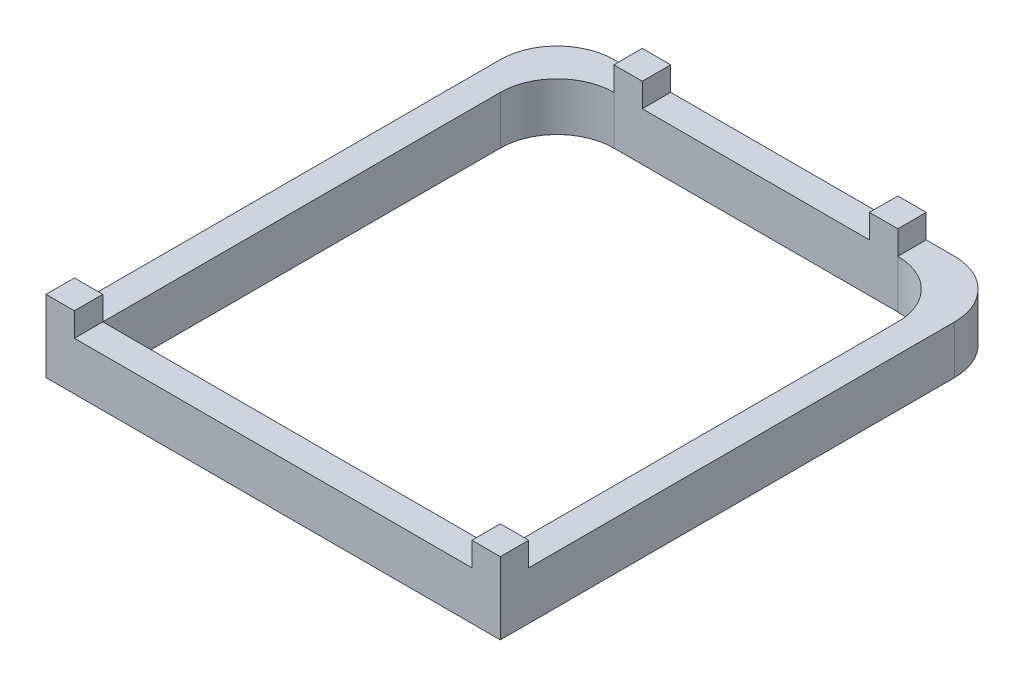
ISO-10303-21;
HEADER;
FILE_DESCRIPTION(('STEP AP214'),'2;1');
FILE_NAME('part.step','',(''),(''),'','','');
FILE_SCHEMA(('AUTOMOTIVE_DESIGN { 1 0 10303 214 1 1 1 1 }'));
ENDSEC;
DATA;
#1=APPLICATION_CONTEXT('core data for automotive mechanical design processes');
#2=APPLICATION_PROTOCOL_DEFINITION('international standard','automotive_design',2000,#1);
#3=PRODUCT_CONTEXT('',#1,'mechanical');
#4=PRODUCT('Part','Part','',(#3));
#5=PRODUCT_RELATED_PRODUCT_CATEGORY('part','',(#4));
#6=PRODUCT_DEFINITION_FORMATION('','',#4);
#7=PRODUCT_DEFINITION_CONTEXT('part definition',#1,'design');
#8=PRODUCT_DEFINITION('design','',#6,#7);
#9=PRODUCT_DEFINITION_SHAPE('','',#8);
#10=(LENGTH_UNIT() NAMED_UNIT(*) SI_UNIT(.MILLI.,.METRE.));
#11=(NAMED_UNIT(*) PLANE_ANGLE_UNIT() SI_UNIT($,.RADIAN.));
#12=(NAMED_UNIT(*) SI_UNIT($,.STERADIAN.) SOLID_ANGLE_UNIT());
#13=UNCERTAINTY_MEASURE_WITH_UNIT(LENGTH_MEASURE(1.E-05),#10,'distance_accuracy_value','');
#14=(GEOMETRIC_REPRESENTATION_CONTEXT(3) GLOBAL_UNCERTAINTY_ASSIGNED_CONTEXT((#13)) GLOBAL_UNIT_ASSIGNED_CONTEXT((#10,
#11,#12)) REPRESENTATION_CONTEXT('',''));
#15=CARTESIAN_POINT('',(0.,0.,0.));
#16=DIRECTION('',(0.,0.,1.));
#17=DIRECTION('',(1.,0.,0.));
#18=AXIS2_PLACEMENT_3D('',#15,#16,#17);
#19=CARTESIAN_POINT('',(-5.00000000000001,1.7,-6.));
#20=DIRECTION('',(0.,1.,0.));
#21=DIRECTION('',(0.,0.,1.));
#22=AXIS2_PLACEMENT_3D('',#19,#20,#21);
#23=PLANE('',#22);
#24=DIRECTION('',(-1.,0.,0.));
#25=VECTOR('',#24,1.);
#26=CARTESIAN_POINT('',(-5.99999999999999,1.7,-9.));
#27=LINE('',#26,#25);
#28=CARTESIAN_POINT('',(5.99999999999999,1.7,-9.));
#29=VERTEX_POINT('',#28);
#30=CARTESIAN_POINT('',(4.99999999999998,1.7,-9.));
#31=VERTEX_POINT('',#30);
#32=EDGE_CURVE('E350',#29,#31,#27,.T.);
#33=ORIENTED_EDGE('',*,*,#32,.T.);
#34=DIRECTION('',(0.,0.,-1.));
#35=VECTOR('',#34,1.);
#36=CARTESIAN_POINT('',(4.99999999999998,1.7,-8.));
#37=LINE('',#36,#35);
#38=CARTESIAN_POINT('',(4.99999999999998,1.7,-8.));
#39=VERTEX_POINT('',#38);
#40=EDGE_CURVE('E701',#39,#31,#37,.T.);
#41=ORIENTED_EDGE('',*,*,#40,.F.);
#42=CARTESIAN_POINT('',(4.99999999999999,1.7,-6.));
#43=DIRECTION('',(0.,1.,0.));
#44=DIRECTION('',(0.,0.,-1.));
#45=AXIS2_PLACEMENT_3D('',#42,#43,#44);
#46=CIRCLE('',#45,2.);
#47=CARTESIAN_POINT('',(6.99999999999999,1.7,-5.99999999999998));
#48=VERTEX_POINT('',#47);
#49=EDGE_CURVE('E300',#48,#39,#46,.T.);
#50=ORIENTED_EDGE('',*,*,#49,.F.);
#51=DIRECTION('',(0.,0.,-1.));
#52=VECTOR('',#51,1.);
#53=CARTESIAN_POINT('',(6.99999999999999,1.7,-5.99999999999998));
#54=LINE('',#53,#52);
#55=CARTESIAN_POINT('',(6.99999999999999,1.7,8.));
#56=VERTEX_POINT('',#55);
#57=EDGE_CURVE('E298',#56,#48,#54,.T.);
#58=ORIENTED_EDGE('',*,*,#57,.F.);
#59=DIRECTION('',(-1.,0.,0.));
#60=VECTOR('',#59,1.);
#61=CARTESIAN_POINT('',(6.99999999999999,1.7,8.));
#62=LINE('',#61,#60);
#63=CARTESIAN_POINT('',(8.00000000000001,1.7,8.));
#64=VERTEX_POINT('',#63);
#65=EDGE_CURVE('E58',#64,#56,#62,.T.);
#66=ORIENTED_EDGE('',*,*,#65,.F.);
#67=DIRECTION('',(0.,0.,-1.));
#68=VECTOR('',#67,1.);
#69=CARTESIAN_POINT('',(8.00000000000001,1.7,-6.99999999999998));
#70=LINE('',#69,#68);
#71=CARTESIAN_POINT('',(8.00000000000001,1.7,-6.99999999999998));
#72=VERTEX_POINT('',#71);
#73=EDGE_CURVE('E344',#64,#72,#70,.T.);
#74=ORIENTED_EDGE('',*,*,#73,.T.);
#75=CARTESIAN_POINT('',(6.00000000000001,1.7,-7.));
#76=DIRECTION('',(0.,1.,0.));
#77=DIRECTION('',(0.,0.,-1.));
#78=AXIS2_PLACEMENT_3D('',#75,#76,#77);
#79=CIRCLE('',#78,2.);
#80=EDGE_CURVE('E346',#72,#29,#79,.T.);
#81=ORIENTED_EDGE('',*,*,#80,.T.);
#82=EDGE_LOOP('',(#33,#41,#50,#58,#66,#74,#81));
#83=FACE_BOUND('',#82,.T.);
#84=ADVANCED_FACE('F35',(#83),#23,.T.);
#85=DIRECTION('',(-1.,0.,0.));
#86=VECTOR('',#85,1.);
#87=CARTESIAN_POINT('',(-4.99999999999999,1.7,-8.));
#88=LINE('',#87,#86);
#89=CARTESIAN_POINT('',(3.99999999999998,1.7,-8.));
#90=VERTEX_POINT('',#89);
#91=CARTESIAN_POINT('',(-4.00000000000001,1.7,-8.));
#92=VERTEX_POINT('',#91);
#93=EDGE_CURVE('E304',#90,#92,#88,.T.);
#94=ORIENTED_EDGE('',*,*,#93,.F.);
#95=DIRECTION('',(0.,0.,1.));
#96=VECTOR('',#95,1.);
#97=CARTESIAN_POINT('',(3.99999999999998,1.7,-9.));
#98=LINE('',#97,#96);
#99=CARTESIAN_POINT('',(3.99999999999998,1.7,-9.));
#100=VERTEX_POINT('',#99);
#101=EDGE_CURVE('E213',#100,#90,#98,.T.);
#102=ORIENTED_EDGE('',*,*,#101,.F.);
#103=CARTESIAN_POINT('',(-4.00000000000001,1.7,-9.));
#104=VERTEX_POINT('',#103);
#105=EDGE_CURVE('E354',#100,#104,#27,.T.);
#106=ORIENTED_EDGE('',*,*,#105,.T.);
#107=DIRECTION('',(0.,0.,-1.));
#108=VECTOR('',#107,1.);
#109=CARTESIAN_POINT('',(-4.00000000000001,1.7,-9.));
#110=LINE('',#109,#108);
#111=EDGE_CURVE('E219',#92,#104,#110,.T.);
#112=ORIENTED_EDGE('',*,*,#111,.F.);
#113=EDGE_LOOP('',(#94,#102,#106,#112));
#114=FACE_BOUND('',#113,.T.);
#115=ADVANCED_FACE('F458',(#114),#23,.T.);
#116=CARTESIAN_POINT('',(-5.00000000000001,1.7,-6.));
#117=DIRECTION('',(0.,1.,0.));
#118=DIRECTION('',(0.,0.,1.));
#119=AXIS2_PLACEMENT_3D('',#116,#117,#118);
#120=CIRCLE('',#119,2.);
#121=CARTESIAN_POINT('',(-4.99999999999999,1.7,-8.));
#122=VERTEX_POINT('',#121);
#123=CARTESIAN_POINT('',(-7.00000000000001,1.7,-5.99999999999998));
#124=VERTEX_POINT('',#123);
#125=EDGE_CURVE('E306',#122,#124,#120,.T.);
#126=ORIENTED_EDGE('',*,*,#125,.F.);
#127=DIRECTION('',(0.,0.,1.));
#128=VECTOR('',#127,1.);
#129=CARTESIAN_POINT('',(-4.99999999999999,1.7,-8.));
#130=LINE('',#129,#128);
#131=CARTESIAN_POINT('',(-5.00000000000001,1.7,-9.));
#132=VERTEX_POINT('',#131);
#133=EDGE_CURVE('E222',#132,#122,#130,.T.);
#134=ORIENTED_EDGE('',*,*,#133,.F.);
#135=CARTESIAN_POINT('',(-5.99999999999999,1.7,-9.));
#136=VERTEX_POINT('',#135);
#137=EDGE_CURVE('E349',#132,#136,#27,.T.);
#138=ORIENTED_EDGE('',*,*,#137,.T.);
#139=CARTESIAN_POINT('',(-6.00000000000001,1.7,-7.));
#140=DIRECTION('',(0.,1.,0.));
#141=DIRECTION('',(0.,0.,1.));
#142=AXIS2_PLACEMENT_3D('',#139,#140,#141);
#143=CIRCLE('',#142,2.);
#144=CARTESIAN_POINT('',(-8.00000000000001,1.7,-6.99999999999998));
#145=VERTEX_POINT('',#144);
#146=EDGE_CURVE('E353',#136,#145,#143,.T.);
#147=ORIENTED_EDGE('',*,*,#146,.T.);
#148=DIRECTION('',(0.,0.,1.));
#149=VECTOR('',#148,1.);
#150=CARTESIAN_POINT('',(-8.00000000000001,1.7,-6.99999999999998));
#151=LINE('',#150,#149);
#152=CARTESIAN_POINT('',(-8.00000000000001,1.7,8.));
#153=VERTEX_POINT('',#152);
#154=EDGE_CURVE('E356',#145,#153,#151,.T.);
#155=ORIENTED_EDGE('',*,*,#154,.T.);
#156=DIRECTION('',(-1.,0.,0.));
#157=VECTOR('',#156,1.);
#158=CARTESIAN_POINT('',(-7.00000000000001,1.7,8.));
#159=LINE('',#158,#157);
#160=CARTESIAN_POINT('',(-7.00000000000001,1.7,8.));
#161=VERTEX_POINT('',#160);
#162=EDGE_CURVE('E277',#161,#153,#159,.T.);
#163=ORIENTED_EDGE('',*,*,#162,.F.);
#164=DIRECTION('',(0.,0.,1.));
#165=VECTOR('',#164,1.);
#166=CARTESIAN_POINT('',(-7.00000000000001,1.7,-5.99999999999998));
#167=LINE('',#166,#165);
#168=EDGE_CURVE('E308',#124,#161,#167,.T.);
#169=ORIENTED_EDGE('',*,*,#168,.F.);
#170=EDGE_LOOP('',(#126,#134,#138,#147,#155,#163,#169));
#171=FACE_BOUND('',#170,.T.);
#172=ADVANCED_FACE('F408',(#171),#23,.T.);
#173=DIRECTION('',(1.,0.,0.));
#174=VECTOR('',#173,1.);
#175=CARTESIAN_POINT('',(-8.00000000000001,1.7,9.));
#176=LINE('',#175,#174);
#177=CARTESIAN_POINT('',(-7.00000000000001,1.7,9.));
#178=VERTEX_POINT('',#177);
#179=CARTESIAN_POINT('',(6.99999999999999,1.7,9.));
#180=VERTEX_POINT('',#179);
#181=EDGE_CURVE('E358',#178,#180,#176,.T.);
#182=ORIENTED_EDGE('',*,*,#181,.T.);
#183=DIRECTION('',(0.,0.,1.));
#184=VECTOR('',#183,1.);
#185=CARTESIAN_POINT('',(6.99999999999999,1.7,8.));
#186=LINE('',#185,#184);
#187=EDGE_CURVE('E249',#56,#180,#186,.T.);
#188=ORIENTED_EDGE('',*,*,#187,.F.);
#189=DIRECTION('',(1.,0.,0.));
#190=VECTOR('',#189,1.);
#191=CARTESIAN_POINT('',(-7.00000000000001,1.7,8.));
#192=LINE('',#191,#190);
#193=EDGE_CURVE('E311',#161,#56,#192,.T.);
#194=ORIENTED_EDGE('',*,*,#193,.F.);
#195=DIRECTION('',(0.,0.,-1.));
#196=VECTOR('',#195,1.);
#197=CARTESIAN_POINT('',(-7.00000000000001,1.7,8.));
#198=LINE('',#197,#196);
#199=EDGE_CURVE('E272',#178,#161,#198,.T.);
#200=ORIENTED_EDGE('',*,*,#199,.F.);
#201=EDGE_LOOP('',(#182,#188,#194,#200));
#202=FACE_BOUND('',#201,.T.);
#203=ADVANCED_FACE('F421',(#202),#23,.T.);
#204=CARTESIAN_POINT('',(-5.00000000000001,0.,-6.));
#205=DIRECTION('',(0.,1.,0.));
#206=DIRECTION('',(0.,0.,1.));
#207=AXIS2_PLACEMENT_3D('',#204,#205,#206);
#208=PLANE('',#207);
#209=DIRECTION('',(0.,0.,-1.));
#210=VECTOR('',#209,1.);
#211=CARTESIAN_POINT('',(8.00000000000001,0.,-6.99999999999998));
#212=LINE('',#211,#210);
#213=CARTESIAN_POINT('',(8.00000000000001,0.,9.));
#214=VERTEX_POINT('',#213);
#215=CARTESIAN_POINT('',(8.00000000000001,0.,-6.99999999999998));
#216=VERTEX_POINT('',#215);
#217=EDGE_CURVE('E343',#214,#216,#212,.T.);
#218=ORIENTED_EDGE('',*,*,#217,.F.);
#219=DIRECTION('',(1.,0.,0.));
#220=VECTOR('',#219,1.);
#221=CARTESIAN_POINT('',(-8.00000000000001,0.,9.));
#222=LINE('',#221,#220);
#223=CARTESIAN_POINT('',(-8.00000000000001,0.,9.));
#224=VERTEX_POINT('',#223);
#225=EDGE_CURVE('E347',#224,#214,#222,.T.);
#226=ORIENTED_EDGE('',*,*,#225,.F.);
#227=DIRECTION('',(0.,0.,1.));
#228=VECTOR('',#227,1.);
#229=CARTESIAN_POINT('',(-8.00000000000001,0.,-6.99999999999998));
#230=LINE('',#229,#228);
#231=CARTESIAN_POINT('',(-8.00000000000001,0.,-6.99999999999998));
#232=VERTEX_POINT('',#231);
#233=EDGE_CURVE('E369',#232,#224,#230,.T.);
#234=ORIENTED_EDGE('',*,*,#233,.F.);
#235=CARTESIAN_POINT('',(-6.00000000000001,0.,-7.));
#236=DIRECTION('',(0.,1.,0.));
#237=DIRECTION('',(0.,0.,1.));
#238=AXIS2_PLACEMENT_3D('',#235,#236,#237);
#239=CIRCLE('',#238,2.);
#240=CARTESIAN_POINT('',(-5.99999999999999,0.,-9.));
#241=VERTEX_POINT('',#240);
#242=EDGE_CURVE('E367',#241,#232,#239,.T.);
#243=ORIENTED_EDGE('',*,*,#242,.F.);
#244=DIRECTION('',(-1.,0.,0.));
#245=VECTOR('',#244,1.);
#246=CARTESIAN_POINT('',(-5.99999999999999,0.,-9.));
#247=LINE('',#246,#245);
#248=CARTESIAN_POINT('',(5.99999999999999,0.,-9.));
#249=VERTEX_POINT('',#248);
#250=EDGE_CURVE('E365',#249,#241,#247,.T.);
#251=ORIENTED_EDGE('',*,*,#250,.F.);
#252=CARTESIAN_POINT('',(6.00000000000001,0.,-7.));
#253=DIRECTION('',(0.,1.,0.));
#254=DIRECTION('',(0.,0.,-1.));
#255=AXIS2_PLACEMENT_3D('',#252,#253,#254);
#256=CIRCLE('',#255,2.);
#257=EDGE_CURVE('E363',#216,#249,#256,.T.);
#258=ORIENTED_EDGE('',*,*,#257,.F.);
#259=EDGE_LOOP('',(#218,#226,#234,#243,#251,#258));
#260=FACE_BOUND('',#259,.T.);
#261=DIRECTION('',(0.,0.,-1.));
#262=VECTOR('',#261,1.);
#263=CARTESIAN_POINT('',(6.99999999999999,0.,-5.99999999999998));
#264=LINE('',#263,#262);
#265=CARTESIAN_POINT('',(6.99999999999999,0.,8.));
#266=VERTEX_POINT('',#265);
#267=CARTESIAN_POINT('',(6.99999999999999,0.,-5.99999999999998));
#268=VERTEX_POINT('',#267);
#269=EDGE_CURVE('E297',#266,#268,#264,.T.);
#270=ORIENTED_EDGE('',*,*,#269,.T.);
#271=CARTESIAN_POINT('',(4.99999999999999,0.,-6.));
#272=DIRECTION('',(0.,1.,0.));
#273=DIRECTION('',(0.,0.,-1.));
#274=AXIS2_PLACEMENT_3D('',#271,#272,#273);
#275=CIRCLE('',#274,2.);
#276=CARTESIAN_POINT('',(4.99999999999998,0.,-8.));
#277=VERTEX_POINT('',#276);
#278=EDGE_CURVE('E317',#268,#277,#275,.T.);
#279=ORIENTED_EDGE('',*,*,#278,.T.);
#280=DIRECTION('',(-1.,0.,0.));
#281=VECTOR('',#280,1.);
#282=CARTESIAN_POINT('',(-4.99999999999999,0.,-8.));
#283=LINE('',#282,#281);
#284=CARTESIAN_POINT('',(-4.99999999999999,0.,-8.));
#285=VERTEX_POINT('',#284);
#286=EDGE_CURVE('E320',#277,#285,#283,.T.);
#287=ORIENTED_EDGE('',*,*,#286,.T.);
#288=CARTESIAN_POINT('',(-5.00000000000001,0.,-6.));
#289=DIRECTION('',(0.,1.,0.));
#290=DIRECTION('',(0.,0.,1.));
#291=AXIS2_PLACEMENT_3D('',#288,#289,#290);
#292=CIRCLE('',#291,2.);
#293=CARTESIAN_POINT('',(-7.00000000000001,0.,-5.99999999999998));
#294=VERTEX_POINT('',#293);
#295=EDGE_CURVE('E323',#285,#294,#292,.T.);
#296=ORIENTED_EDGE('',*,*,#295,.T.);
#297=DIRECTION('',(0.,0.,1.));
#298=VECTOR('',#297,1.);
#299=CARTESIAN_POINT('',(-7.00000000000001,0.,-5.99999999999998));
#300=LINE('',#299,#298);
#301=CARTESIAN_POINT('',(-7.00000000000001,0.,8.));
#302=VERTEX_POINT('',#301);
#303=EDGE_CURVE('E326',#294,#302,#300,.T.);
#304=ORIENTED_EDGE('',*,*,#303,.T.);
#305=DIRECTION('',(1.,0.,0.));
#306=VECTOR('',#305,1.);
#307=CARTESIAN_POINT('',(-7.00000000000001,0.,8.));
#308=LINE('',#307,#306);
#309=EDGE_CURVE('E301',#302,#266,#308,.T.);
#310=ORIENTED_EDGE('',*,*,#309,.T.);
#311=EDGE_LOOP('',(#270,#279,#287,#296,#304,#310));
#312=FACE_BOUND('',#311,.T.);
#313=ADVANCED_FACE('F37',(#260,#312),#208,.F.);
#314=CARTESIAN_POINT('',(8.00000000000001,1.7,-6.99999999999998));
#315=DIRECTION('',(-1.,0.,0.));
#316=DIRECTION('',(0.,0.,1.));
#317=AXIS2_PLACEMENT_3D('',#314,#315,#316);
#318=PLANE('',#317);
#319=ORIENTED_EDGE('',*,*,#217,.T.);
#320=DIRECTION('',(0.,-1.,0.));
#321=VECTOR('',#320,1.);
#322=CARTESIAN_POINT('',(8.00000000000001,1.7,-6.99999999999998));
#323=LINE('',#322,#321);
#324=EDGE_CURVE('E11',#72,#216,#323,.T.);
#325=ORIENTED_EDGE('',*,*,#324,.F.);
#326=ORIENTED_EDGE('',*,*,#73,.F.);
#327=DIRECTION('',(0.,-1.,0.));
#328=VECTOR('',#327,1.);
#329=CARTESIAN_POINT('',(8.00000000000001,2.54,8.));
#330=LINE('',#329,#328);
#331=CARTESIAN_POINT('',(8.00000000000001,2.54,8.));
#332=VERTEX_POINT('',#331);
#333=EDGE_CURVE('E266',#332,#64,#330,.T.);
#334=ORIENTED_EDGE('',*,*,#333,.F.);
#335=DIRECTION('',(0.,0.,-1.));
#336=VECTOR('',#335,1.);
#337=CARTESIAN_POINT('',(8.00000000000001,2.54,8.));
#338=LINE('',#337,#336);
#339=CARTESIAN_POINT('',(8.00000000000001,2.54,9.));
#340=VERTEX_POINT('',#339);
#341=EDGE_CURVE('E256',#340,#332,#338,.T.);
#342=ORIENTED_EDGE('',*,*,#341,.F.);
#343=DIRECTION('',(0.,-1.,0.));
#344=VECTOR('',#343,1.);
#345=CARTESIAN_POINT('',(8.00000000000001,1.7,9.));
#346=LINE('',#345,#344);
#347=EDGE_CURVE('E360',#340,#214,#346,.T.);
#348=ORIENTED_EDGE('',*,*,#347,.T.);
#349=EDGE_LOOP('',(#319,#325,#326,#334,#342,#348));
#350=FACE_BOUND('',#349,.T.);
#351=ADVANCED_FACE('F444',(#350),#318,.F.);
#352=CARTESIAN_POINT('',(6.00000000000001,1.7,-7.));
#353=DIRECTION('',(0.,-1.,0.));
#354=DIRECTION('',(0.,0.,-1.));
#355=AXIS2_PLACEMENT_3D('',#352,#353,#354);
#356=CYLINDRICAL_SURFACE('',#355,2.);
#357=ORIENTED_EDGE('',*,*,#257,.T.);
#358=DIRECTION('',(0.,-1.,0.));
#359=VECTOR('',#358,1.);
#360=CARTESIAN_POINT('',(5.99999999999999,1.7,-9.));
#361=LINE('',#360,#359);
#362=EDGE_CURVE('E43',#29,#249,#361,.T.);
#363=ORIENTED_EDGE('',*,*,#362,.F.);
#364=ORIENTED_EDGE('',*,*,#80,.F.);
#365=ORIENTED_EDGE('',*,*,#324,.T.);
#366=EDGE_LOOP('',(#357,#363,#364,#365));
#367=FACE_BOUND('',#366,.T.);
#368=ADVANCED_FACE('F446',(#367),#356,.T.);
#369=CARTESIAN_POINT('',(-5.99999999999999,1.7,-9.));
#370=DIRECTION('',(0.,0.,1.));
#371=DIRECTION('',(1.,0.,0.));
#372=AXIS2_PLACEMENT_3D('',#369,#370,#371);
#373=PLANE('',#372);
#374=ORIENTED_EDGE('',*,*,#250,.T.);
#375=DIRECTION('',(0.,-1.,0.));
#376=VECTOR('',#375,1.);
#377=CARTESIAN_POINT('',(-5.99999999999999,1.7,-9.));
#378=LINE('',#377,#376);
#379=EDGE_CURVE('E380',#136,#241,#378,.T.);
#380=ORIENTED_EDGE('',*,*,#379,.F.);
#381=ORIENTED_EDGE('',*,*,#137,.F.);
#382=DIRECTION('',(0.,-1.,0.));
#383=VECTOR('',#382,1.);
#384=CARTESIAN_POINT('',(-5.00000000000001,2.54,-9.));
#385=LINE('',#384,#383);
#386=CARTESIAN_POINT('',(-5.00000000000001,2.54,-9.));
#387=VERTEX_POINT('',#386);
#388=EDGE_CURVE('E241',#387,#132,#385,.T.);
#389=ORIENTED_EDGE('',*,*,#388,.F.);
#390=DIRECTION('',(-1.,0.,0.));
#391=VECTOR('',#390,1.);
#392=CARTESIAN_POINT('',(-5.00000000000001,2.54,-9.));
#393=LINE('',#392,#391);
#394=CARTESIAN_POINT('',(-4.00000000000001,2.54,-9.));
#395=VERTEX_POINT('',#394);
#396=EDGE_CURVE('E233',#395,#387,#393,.T.);
#397=ORIENTED_EDGE('',*,*,#396,.F.);
#398=DIRECTION('',(0.,-1.,0.));
#399=VECTOR('',#398,1.);
#400=CARTESIAN_POINT('',(-4.00000000000001,2.54,-9.));
#401=LINE('',#400,#399);
#402=EDGE_CURVE('E243',#395,#104,#401,.T.);
#403=ORIENTED_EDGE('',*,*,#402,.T.);
#404=ORIENTED_EDGE('',*,*,#105,.F.);
#405=DIRECTION('',(0.,-1.,0.));
#406=VECTOR('',#405,1.);
#407=CARTESIAN_POINT('',(3.99999999999998,2.54,-9.));
#408=LINE('',#407,#406);
#409=CARTESIAN_POINT('',(3.99999999999998,2.54,-9.));
#410=VERTEX_POINT('',#409);
#411=EDGE_CURVE('E224',#410,#100,#408,.T.);
#412=ORIENTED_EDGE('',*,*,#411,.F.);
#413=DIRECTION('',(-1.,0.,0.));
#414=VECTOR('',#413,1.);
#415=CARTESIAN_POINT('',(4.99999999999998,2.54,-9.));
#416=LINE('',#415,#414);
#417=CARTESIAN_POINT('',(4.99999999999998,2.54,-9.));
#418=VERTEX_POINT('',#417);
#419=EDGE_CURVE('E207',#418,#410,#416,.T.);
#420=ORIENTED_EDGE('',*,*,#419,.F.);
#421=DIRECTION('',(0.,-1.,0.));
#422=VECTOR('',#421,1.);
#423=CARTESIAN_POINT('',(4.99999999999998,2.54,-9.));
#424=LINE('',#423,#422);
#425=EDGE_CURVE('E204',#418,#31,#424,.T.);
#426=ORIENTED_EDGE('',*,*,#425,.T.);
#427=ORIENTED_EDGE('',*,*,#32,.F.);
#428=ORIENTED_EDGE('',*,*,#362,.T.);
#429=EDGE_LOOP('',(#374,#380,#381,#389,#397,#403,#404,#412,#420,#426,#427,#428));
#430=FACE_BOUND('',#429,.T.);
#431=ADVANCED_FACE('F387',(#430),#373,.F.);
#432=CARTESIAN_POINT('',(-6.00000000000001,1.7,-7.));
#433=DIRECTION('',(0.,-1.,0.));
#434=DIRECTION('',(0.,0.,-1.));
#435=AXIS2_PLACEMENT_3D('',#432,#433,#434);
#436=CYLINDRICAL_SURFACE('',#435,2.);
#437=ORIENTED_EDGE('',*,*,#242,.T.);
#438=DIRECTION('',(0.,-1.,0.));
#439=VECTOR('',#438,1.);
#440=CARTESIAN_POINT('',(-8.00000000000001,1.7,-6.99999999999998));
#441=LINE('',#440,#439);
#442=EDGE_CURVE('E377',#145,#232,#441,.T.);
#443=ORIENTED_EDGE('',*,*,#442,.F.);
#444=ORIENTED_EDGE('',*,*,#146,.F.);
#445=ORIENTED_EDGE('',*,*,#379,.T.);
#446=EDGE_LOOP('',(#437,#443,#444,#445));
#447=FACE_BOUND('',#446,.T.);
#448=ADVANCED_FACE('F399',(#447),#436,.T.);
#449=CARTESIAN_POINT('',(-8.00000000000001,1.7,-6.99999999999998));
#450=DIRECTION('',(1.,0.,0.));
#451=DIRECTION('',(0.,0.,-1.));
#452=AXIS2_PLACEMENT_3D('',#449,#450,#451);
#453=PLANE('',#452);
#454=ORIENTED_EDGE('',*,*,#233,.T.);
#455=DIRECTION('',(0.,-1.,0.));
#456=VECTOR('',#455,1.);
#457=CARTESIAN_POINT('',(-8.00000000000001,1.7,9.));
#458=LINE('',#457,#456);
#459=CARTESIAN_POINT('',(-8.00000000000001,2.54,9.));
#460=VERTEX_POINT('',#459);
#461=EDGE_CURVE('E374',#460,#224,#458,.T.);
#462=ORIENTED_EDGE('',*,*,#461,.F.);
#463=DIRECTION('',(0.,0.,1.));
#464=VECTOR('',#463,1.);
#465=CARTESIAN_POINT('',(-8.00000000000001,2.54,8.));
#466=LINE('',#465,#464);
#467=CARTESIAN_POINT('',(-8.00000000000001,2.54,8.));
#468=VERTEX_POINT('',#467);
#469=EDGE_CURVE('E279',#468,#460,#466,.T.);
#470=ORIENTED_EDGE('',*,*,#469,.F.);
#471=DIRECTION('',(0.,-1.,0.));
#472=VECTOR('',#471,1.);
#473=CARTESIAN_POINT('',(-8.00000000000001,2.54,8.));
#474=LINE('',#473,#472);
#475=EDGE_CURVE('E291',#468,#153,#474,.T.);
#476=ORIENTED_EDGE('',*,*,#475,.T.);
#477=ORIENTED_EDGE('',*,*,#154,.F.);
#478=ORIENTED_EDGE('',*,*,#442,.T.);
#479=EDGE_LOOP('',(#454,#462,#470,#476,#477,#478));
#480=FACE_BOUND('',#479,.T.);
#481=ADVANCED_FACE('F403',(#480),#453,.F.);
#482=CARTESIAN_POINT('',(-8.00000000000001,1.7,9.));
#483=DIRECTION('',(0.,0.,-1.));
#484=DIRECTION('',(-1.,0.,0.));
#485=AXIS2_PLACEMENT_3D('',#482,#483,#484);
#486=PLANE('',#485);
#487=ORIENTED_EDGE('',*,*,#225,.T.);
#488=ORIENTED_EDGE('',*,*,#347,.F.);
#489=DIRECTION('',(1.,0.,0.));
#490=VECTOR('',#489,1.);
#491=CARTESIAN_POINT('',(6.99999999999999,2.54,9.));
#492=LINE('',#491,#490);
#493=CARTESIAN_POINT('',(6.99999999999999,2.54,9.));
#494=VERTEX_POINT('',#493);
#495=EDGE_CURVE('E253',#494,#340,#492,.T.);
#496=ORIENTED_EDGE('',*,*,#495,.F.);
#497=DIRECTION('',(0.,-1.,0.));
#498=VECTOR('',#497,1.);
#499=CARTESIAN_POINT('',(6.99999999999999,2.54,9.));
#500=LINE('',#499,#498);
#501=EDGE_CURVE('E269',#494,#180,#500,.T.);
#502=ORIENTED_EDGE('',*,*,#501,.T.);
#503=ORIENTED_EDGE('',*,*,#181,.F.);
#504=DIRECTION('',(0.,-1.,0.));
#505=VECTOR('',#504,1.);
#506=CARTESIAN_POINT('',(-7.00000000000001,2.54,9.));
#507=LINE('',#506,#505);
#508=CARTESIAN_POINT('',(-7.00000000000001,2.54,9.));
#509=VERTEX_POINT('',#508);
#510=EDGE_CURVE('E284',#509,#178,#507,.T.);
#511=ORIENTED_EDGE('',*,*,#510,.F.);
#512=DIRECTION('',(1.,0.,0.));
#513=VECTOR('',#512,1.);
#514=CARTESIAN_POINT('',(-7.00000000000001,2.54,9.));
#515=LINE('',#514,#513);
#516=EDGE_CURVE('E282',#460,#509,#515,.T.);
#517=ORIENTED_EDGE('',*,*,#516,.F.);
#518=ORIENTED_EDGE('',*,*,#461,.T.);
#519=EDGE_LOOP('',(#487,#488,#496,#502,#503,#511,#517,#518));
#520=FACE_BOUND('',#519,.T.);
#521=ADVANCED_FACE('F423',(#520),#486,.F.);
#522=CARTESIAN_POINT('',(6.99999999999999,1.7,-5.99999999999998));
#523=DIRECTION('',(-1.,0.,0.));
#524=DIRECTION('',(0.,0.,1.));
#525=AXIS2_PLACEMENT_3D('',#522,#523,#524);
#526=PLANE('',#525);
#527=ORIENTED_EDGE('',*,*,#269,.F.);
#528=DIRECTION('',(0.,-1.,0.));
#529=VECTOR('',#528,1.);
#530=CARTESIAN_POINT('',(6.99999999999999,1.7,8.));
#531=LINE('',#530,#529);
#532=EDGE_CURVE('E314',#56,#266,#531,.T.);
#533=ORIENTED_EDGE('',*,*,#532,.F.);
#534=ORIENTED_EDGE('',*,*,#57,.T.);
#535=DIRECTION('',(0.,-1.,0.));
#536=VECTOR('',#535,1.);
#537=CARTESIAN_POINT('',(6.99999999999999,1.7,-5.99999999999998));
#538=LINE('',#537,#536);
#539=EDGE_CURVE('E340',#48,#268,#538,.T.);
#540=ORIENTED_EDGE('',*,*,#539,.T.);
#541=EDGE_LOOP('',(#527,#533,#534,#540));
#542=FACE_BOUND('',#541,.T.);
#543=ADVANCED_FACE('F435',(#542),#526,.T.);
#544=CARTESIAN_POINT('',(4.99999999999999,1.7,-6.));
#545=DIRECTION('',(0.,-1.,0.));
#546=DIRECTION('',(0.,0.,-1.));
#547=AXIS2_PLACEMENT_3D('',#544,#545,#546);
#548=CYLINDRICAL_SURFACE('',#547,2.);
#549=ORIENTED_EDGE('',*,*,#278,.F.);
#550=ORIENTED_EDGE('',*,*,#539,.F.);
#551=ORIENTED_EDGE('',*,*,#49,.T.);
#552=DIRECTION('',(0.,-1.,0.));
#553=VECTOR('',#552,1.);
#554=CARTESIAN_POINT('',(4.99999999999998,1.7,-8.));
#555=LINE('',#554,#553);
#556=EDGE_CURVE('E218',#39,#277,#555,.T.);
#557=ORIENTED_EDGE('',*,*,#556,.T.);
#558=EDGE_LOOP('',(#549,#550,#551,#557));
#559=FACE_BOUND('',#558,.T.);
#560=ADVANCED_FACE('F548',(#559),#548,.F.);
#561=CARTESIAN_POINT('',(-4.99999999999999,1.7,-8.));
#562=DIRECTION('',(0.,0.,1.));
#563=DIRECTION('',(1.,0.,0.));
#564=AXIS2_PLACEMENT_3D('',#561,#562,#563);
#565=PLANE('',#564);
#566=ORIENTED_EDGE('',*,*,#286,.F.);
#567=ORIENTED_EDGE('',*,*,#556,.F.);
#568=DIRECTION('',(0.,-1.,0.));
#569=VECTOR('',#568,1.);
#570=CARTESIAN_POINT('',(4.99999999999998,2.54,-8.));
#571=LINE('',#570,#569);
#572=CARTESIAN_POINT('',(4.99999999999998,2.54,-8.));
#573=VERTEX_POINT('',#572);
#574=EDGE_CURVE('E201',#573,#39,#571,.T.);
#575=ORIENTED_EDGE('',*,*,#574,.F.);
#576=DIRECTION('',(1.,0.,0.));
#577=VECTOR('',#576,1.);
#578=CARTESIAN_POINT('',(3.99999999999998,2.54,-8.));
#579=LINE('',#578,#577);
#580=CARTESIAN_POINT('',(3.99999999999998,2.54,-8.));
#581=VERTEX_POINT('',#580);
#582=EDGE_CURVE('E208',#581,#573,#579,.T.);
#583=ORIENTED_EDGE('',*,*,#582,.F.);
#584=DIRECTION('',(0.,-1.,0.));
#585=VECTOR('',#584,1.);
#586=CARTESIAN_POINT('',(3.99999999999998,2.54,-8.));
#587=LINE('',#586,#585);
#588=EDGE_CURVE('E50',#581,#90,#587,.T.);
#589=ORIENTED_EDGE('',*,*,#588,.T.);
#590=ORIENTED_EDGE('',*,*,#93,.T.);
#591=DIRECTION('',(0.,-1.,0.));
#592=VECTOR('',#591,1.);
#593=CARTESIAN_POINT('',(-4.00000000000001,2.54,-8.));
#594=LINE('',#593,#592);
#595=CARTESIAN_POINT('',(-4.00000000000001,2.54,-8.));
#596=VERTEX_POINT('',#595);
#597=EDGE_CURVE('E246',#596,#92,#594,.T.);
#598=ORIENTED_EDGE('',*,*,#597,.F.);
#599=DIRECTION('',(1.,0.,0.));
#600=VECTOR('',#599,1.);
#601=CARTESIAN_POINT('',(-4.00000000000001,2.54,-8.));
#602=LINE('',#601,#600);
#603=CARTESIAN_POINT('',(-4.99999999999999,2.54,-8.));
#604=VERTEX_POINT('',#603);
#605=EDGE_CURVE('E228',#604,#596,#602,.T.);
#606=ORIENTED_EDGE('',*,*,#605,.F.);
#607=DIRECTION('',(0.,-1.,0.));
#608=VECTOR('',#607,1.);
#609=CARTESIAN_POINT('',(-4.99999999999999,2.54,-8.));
#610=LINE('',#609,#608);
#611=EDGE_CURVE('E236',#604,#122,#610,.T.);
#612=ORIENTED_EDGE('',*,*,#611,.T.);
#613=DIRECTION('',(0.,-1.,0.));
#614=VECTOR('',#613,1.);
#615=CARTESIAN_POINT('',(-4.99999999999999,1.7,-8.));
#616=LINE('',#615,#614);
#617=EDGE_CURVE('E337',#122,#285,#616,.T.);
#618=ORIENTED_EDGE('',*,*,#617,.T.);
#619=EDGE_LOOP('',(#566,#567,#575,#583,#589,#590,#598,#606,#612,#618));
#620=FACE_BOUND('',#619,.T.);
#621=ADVANCED_FACE('F217',(#620),#565,.T.);
#622=CARTESIAN_POINT('',(-5.00000000000001,1.7,-6.));
#623=DIRECTION('',(0.,-1.,0.));
#624=DIRECTION('',(0.,0.,-1.));
#625=AXIS2_PLACEMENT_3D('',#622,#623,#624);
#626=CYLINDRICAL_SURFACE('',#625,2.);
#627=ORIENTED_EDGE('',*,*,#295,.F.);
#628=ORIENTED_EDGE('',*,*,#617,.F.);
#629=ORIENTED_EDGE('',*,*,#125,.T.);
#630=DIRECTION('',(0.,-1.,0.));
#631=VECTOR('',#630,1.);
#632=CARTESIAN_POINT('',(-7.00000000000001,1.7,-5.99999999999998));
#633=LINE('',#632,#631);
#634=EDGE_CURVE('E335',#124,#294,#633,.T.);
#635=ORIENTED_EDGE('',*,*,#634,.T.);
#636=EDGE_LOOP('',(#627,#628,#629,#635));
#637=FACE_BOUND('',#636,.T.);
#638=ADVANCED_FACE('F567',(#637),#626,.F.);
#639=CARTESIAN_POINT('',(-7.00000000000001,1.7,-5.99999999999998));
#640=DIRECTION('',(1.,0.,0.));
#641=DIRECTION('',(0.,0.,-1.));
#642=AXIS2_PLACEMENT_3D('',#639,#640,#641);
#643=PLANE('',#642);
#644=ORIENTED_EDGE('',*,*,#303,.F.);
#645=ORIENTED_EDGE('',*,*,#634,.F.);
#646=ORIENTED_EDGE('',*,*,#168,.T.);
#647=DIRECTION('',(0.,-1.,0.));
#648=VECTOR('',#647,1.);
#649=CARTESIAN_POINT('',(-7.00000000000001,1.7,8.));
#650=LINE('',#649,#648);
#651=EDGE_CURVE('E333',#161,#302,#650,.T.);
#652=ORIENTED_EDGE('',*,*,#651,.T.);
#653=EDGE_LOOP('',(#644,#645,#646,#652));
#654=FACE_BOUND('',#653,.T.);
#655=ADVANCED_FACE('F577',(#654),#643,.T.);
#656=CARTESIAN_POINT('',(-7.00000000000001,1.7,8.));
#657=DIRECTION('',(0.,0.,-1.));
#658=DIRECTION('',(-1.,0.,0.));
#659=AXIS2_PLACEMENT_3D('',#656,#657,#658);
#660=PLANE('',#659);
#661=ORIENTED_EDGE('',*,*,#309,.F.);
#662=ORIENTED_EDGE('',*,*,#651,.F.);
#663=ORIENTED_EDGE('',*,*,#193,.T.);
#664=ORIENTED_EDGE('',*,*,#532,.T.);
#665=EDGE_LOOP('',(#661,#662,#663,#664));
#666=FACE_BOUND('',#665,.T.);
#667=ADVANCED_FACE('F433',(#666),#660,.T.);
#668=CARTESIAN_POINT('',(-7.00000000000001,2.54,8.));
#669=DIRECTION('',(-1.,0.,0.));
#670=DIRECTION('',(0.,0.,1.));
#671=AXIS2_PLACEMENT_3D('',#668,#669,#670);
#672=PLANE('',#671);
#673=ORIENTED_EDGE('',*,*,#199,.T.);
#674=DIRECTION('',(0.,-1.,0.));
#675=VECTOR('',#674,1.);
#676=CARTESIAN_POINT('',(-7.00000000000001,2.54,8.));
#677=LINE('',#676,#675);
#678=CARTESIAN_POINT('',(-7.00000000000001,2.54,8.));
#679=VERTEX_POINT('',#678);
#680=EDGE_CURVE('E294',#679,#161,#677,.T.);
#681=ORIENTED_EDGE('',*,*,#680,.F.);
#682=DIRECTION('',(0.,0.,-1.));
#683=VECTOR('',#682,1.);
#684=CARTESIAN_POINT('',(-7.00000000000001,2.54,8.));
#685=LINE('',#684,#683);
#686=EDGE_CURVE('E273',#509,#679,#685,.T.);
#687=ORIENTED_EDGE('',*,*,#686,.F.);
#688=ORIENTED_EDGE('',*,*,#510,.T.);
#689=EDGE_LOOP('',(#673,#681,#687,#688));
#690=FACE_BOUND('',#689,.T.);
#691=ADVANCED_FACE('F416',(#690),#672,.F.);
#692=CARTESIAN_POINT('',(-7.00000000000001,2.54,8.));
#693=DIRECTION('',(0.,0.,1.));
#694=DIRECTION('',(1.,0.,0.));
#695=AXIS2_PLACEMENT_3D('',#692,#693,#694);
#696=PLANE('',#695);
#697=ORIENTED_EDGE('',*,*,#162,.T.);
#698=ORIENTED_EDGE('',*,*,#475,.F.);
#699=DIRECTION('',(-1.,0.,0.));
#700=VECTOR('',#699,1.);
#701=CARTESIAN_POINT('',(-7.00000000000001,2.54,8.));
#702=LINE('',#701,#700);
#703=EDGE_CURVE('E276',#679,#468,#702,.T.);
#704=ORIENTED_EDGE('',*,*,#703,.F.);
#705=ORIENTED_EDGE('',*,*,#680,.T.);
#706=EDGE_LOOP('',(#697,#698,#704,#705));
#707=FACE_BOUND('',#706,.T.);
#708=ADVANCED_FACE('F412',(#707),#696,.F.);
#709=CARTESIAN_POINT('',(0.,2.54,0.));
#710=DIRECTION('',(0.,-1.,0.));
#711=DIRECTION('',(0.,0.,-1.));
#712=AXIS2_PLACEMENT_3D('',#709,#710,#711);
#713=PLANE('',#712);
#714=ORIENTED_EDGE('',*,*,#686,.T.);
#715=ORIENTED_EDGE('',*,*,#703,.T.);
#716=ORIENTED_EDGE('',*,*,#469,.T.);
#717=ORIENTED_EDGE('',*,*,#516,.T.);
#718=EDGE_LOOP('',(#714,#715,#716,#717));
#719=FACE_BOUND('',#718,.T.);
#720=ADVANCED_FACE('F448',(#719),#713,.F.);
#721=CARTESIAN_POINT('',(6.99999999999999,2.54,8.));
#722=DIRECTION('',(1.,0.,0.));
#723=DIRECTION('',(0.,0.,-1.));
#724=AXIS2_PLACEMENT_3D('',#721,#722,#723);
#725=PLANE('',#724);
#726=ORIENTED_EDGE('',*,*,#187,.T.);
#727=ORIENTED_EDGE('',*,*,#501,.F.);
#728=DIRECTION('',(0.,0.,1.));
#729=VECTOR('',#728,1.);
#730=CARTESIAN_POINT('',(6.99999999999999,2.54,8.));
#731=LINE('',#730,#729);
#732=CARTESIAN_POINT('',(6.99999999999999,2.54,8.));
#733=VERTEX_POINT('',#732);
#734=EDGE_CURVE('E250',#733,#494,#731,.T.);
#735=ORIENTED_EDGE('',*,*,#734,.F.);
#736=DIRECTION('',(0.,-1.,0.));
#737=VECTOR('',#736,1.);
#738=CARTESIAN_POINT('',(6.99999999999999,2.54,8.));
#739=LINE('',#738,#737);
#740=EDGE_CURVE('E260',#733,#56,#739,.T.);
#741=ORIENTED_EDGE('',*,*,#740,.T.);
#742=EDGE_LOOP('',(#726,#727,#735,#741));
#743=FACE_BOUND('',#742,.T.);
#744=ADVANCED_FACE('F428',(#743),#725,.F.);
#745=CARTESIAN_POINT('',(6.99999999999999,2.54,8.));
#746=DIRECTION('',(0.,0.,1.));
#747=DIRECTION('',(1.,0.,0.));
#748=AXIS2_PLACEMENT_3D('',#745,#746,#747);
#749=PLANE('',#748);
#750=ORIENTED_EDGE('',*,*,#65,.T.);
#751=ORIENTED_EDGE('',*,*,#740,.F.);
#752=DIRECTION('',(-1.,0.,0.));
#753=VECTOR('',#752,1.);
#754=CARTESIAN_POINT('',(6.99999999999999,2.54,8.));
#755=LINE('',#754,#753);
#756=EDGE_CURVE('E258',#332,#733,#755,.T.);
#757=ORIENTED_EDGE('',*,*,#756,.F.);
#758=ORIENTED_EDGE('',*,*,#333,.T.);
#759=EDGE_LOOP('',(#750,#751,#757,#758));
#760=FACE_BOUND('',#759,.T.);
#761=ADVANCED_FACE('F439',(#760),#749,.F.);
#762=CARTESIAN_POINT('',(0.,2.54,0.));
#763=DIRECTION('',(0.,1.,0.));
#764=DIRECTION('',(0.,0.,1.));
#765=AXIS2_PLACEMENT_3D('',#762,#763,#764);
#766=PLANE('',#765);
#767=ORIENTED_EDGE('',*,*,#734,.T.);
#768=ORIENTED_EDGE('',*,*,#495,.T.);
#769=ORIENTED_EDGE('',*,*,#341,.T.);
#770=ORIENTED_EDGE('',*,*,#756,.T.);
#771=EDGE_LOOP('',(#767,#768,#769,#770));
#772=FACE_BOUND('',#771,.T.);
#773=ADVANCED_FACE('F628',(#772),#766,.T.);
#774=CARTESIAN_POINT('',(-4.00000000000001,2.54,-9.));
#775=DIRECTION('',(-1.,0.,0.));
#776=DIRECTION('',(0.,0.,1.));
#777=AXIS2_PLACEMENT_3D('',#774,#775,#776);
#778=PLANE('',#777);
#779=ORIENTED_EDGE('',*,*,#111,.T.);
#780=ORIENTED_EDGE('',*,*,#402,.F.);
#781=DIRECTION('',(0.,0.,-1.));
#782=VECTOR('',#781,1.);
#783=CARTESIAN_POINT('',(-4.00000000000001,2.54,-9.));
#784=LINE('',#783,#782);
#785=EDGE_CURVE('E231',#596,#395,#784,.T.);
#786=ORIENTED_EDGE('',*,*,#785,.F.);
#787=ORIENTED_EDGE('',*,*,#597,.T.);
#788=EDGE_LOOP('',(#779,#780,#786,#787));
#789=FACE_BOUND('',#788,.T.);
#790=ADVANCED_FACE('F637',(#789),#778,.F.);
#791=CARTESIAN_POINT('',(-4.99999999999999,2.54,-8.));
#792=DIRECTION('',(1.,0.,0.));
#793=DIRECTION('',(0.,0.,-1.));
#794=AXIS2_PLACEMENT_3D('',#791,#792,#793);
#795=PLANE('',#794);
#796=ORIENTED_EDGE('',*,*,#133,.T.);
#797=ORIENTED_EDGE('',*,*,#611,.F.);
#798=DIRECTION('',(0.,0.,1.));
#799=VECTOR('',#798,1.);
#800=CARTESIAN_POINT('',(-4.99999999999999,2.54,-8.));
#801=LINE('',#800,#799);
#802=EDGE_CURVE('E235',#387,#604,#801,.T.);
#803=ORIENTED_EDGE('',*,*,#802,.F.);
#804=ORIENTED_EDGE('',*,*,#388,.T.);
#805=EDGE_LOOP('',(#796,#797,#803,#804));
#806=FACE_BOUND('',#805,.T.);
#807=ADVANCED_FACE('F647',(#806),#795,.F.);
#808=CARTESIAN_POINT('',(0.,2.54,0.));
#809=DIRECTION('',(0.,-1.,0.));
#810=DIRECTION('',(0.,0.,-1.));
#811=AXIS2_PLACEMENT_3D('',#808,#809,#810);
#812=PLANE('',#811);
#813=ORIENTED_EDGE('',*,*,#605,.T.);
#814=ORIENTED_EDGE('',*,*,#785,.T.);
#815=ORIENTED_EDGE('',*,*,#396,.T.);
#816=ORIENTED_EDGE('',*,*,#802,.T.);
#817=EDGE_LOOP('',(#813,#814,#815,#816));
#818=FACE_BOUND('',#817,.T.);
#819=ADVANCED_FACE('F657',(#818),#812,.F.);
#820=CARTESIAN_POINT('',(4.99999999999998,2.54,-8.));
#821=DIRECTION('',(-1.,0.,0.));
#822=DIRECTION('',(0.,0.,1.));
#823=AXIS2_PLACEMENT_3D('',#820,#821,#822);
#824=PLANE('',#823);
#825=ORIENTED_EDGE('',*,*,#40,.T.);
#826=ORIENTED_EDGE('',*,*,#425,.F.);
#827=DIRECTION('',(0.,0.,-1.));
#828=VECTOR('',#827,1.);
#829=CARTESIAN_POINT('',(4.99999999999998,2.54,-8.));
#830=LINE('',#829,#828);
#831=EDGE_CURVE('E197',#573,#418,#830,.T.);
#832=ORIENTED_EDGE('',*,*,#831,.F.);
#833=ORIENTED_EDGE('',*,*,#574,.T.);
#834=EDGE_LOOP('',(#825,#826,#832,#833));
#835=FACE_BOUND('',#834,.T.);
#836=ADVANCED_FACE('F199',(#835),#824,.F.);
#837=CARTESIAN_POINT('',(3.99999999999998,2.54,-9.));
#838=DIRECTION('',(1.,0.,0.));
#839=DIRECTION('',(0.,0.,-1.));
#840=AXIS2_PLACEMENT_3D('',#837,#838,#839);
#841=PLANE('',#840);
#842=ORIENTED_EDGE('',*,*,#101,.T.);
#843=ORIENTED_EDGE('',*,*,#588,.F.);
#844=DIRECTION('',(0.,0.,1.));
#845=VECTOR('',#844,1.);
#846=CARTESIAN_POINT('',(3.99999999999998,2.54,-9.));
#847=LINE('',#846,#845);
#848=EDGE_CURVE('E212',#410,#581,#847,.T.);
#849=ORIENTED_EDGE('',*,*,#848,.F.);
#850=ORIENTED_EDGE('',*,*,#411,.T.);
#851=EDGE_LOOP('',(#842,#843,#849,#850));
#852=FACE_BOUND('',#851,.T.);
#853=ADVANCED_FACE('F676',(#852),#841,.F.);
#854=CARTESIAN_POINT('',(0.,2.54,0.));
#855=DIRECTION('',(0.,1.,0.));
#856=DIRECTION('',(0.,0.,1.));
#857=AXIS2_PLACEMENT_3D('',#854,#855,#856);
#858=PLANE('',#857);
#859=ORIENTED_EDGE('',*,*,#582,.T.);
#860=ORIENTED_EDGE('',*,*,#831,.T.);
#861=ORIENTED_EDGE('',*,*,#419,.T.);
#862=ORIENTED_EDGE('',*,*,#848,.T.);
#863=EDGE_LOOP('',(#859,#860,#861,#862));
#864=FACE_BOUND('',#863,.T.);
#865=ADVANCED_FACE('F210',(#864),#858,.T.);
#866=CLOSED_SHELL('',(#84,#115,#172,#203,#313,#351,#368,#431,#448,#481,#521,#543,#560,#621,#638,
#655,#667,#691,#708,#720,#744,#761,#773,#790,#807,#819,#836,#853,#865));
#867=MANIFOLD_SOLID_BREP('B2',#866);
#868=ADVANCED_BREP_SHAPE_REPRESENTATION('',(#18,#867),#14);
#869=SHAPE_DEFINITION_REPRESENTATION(#9,#868);
ENDSEC;
END-ISO-10303-21;
